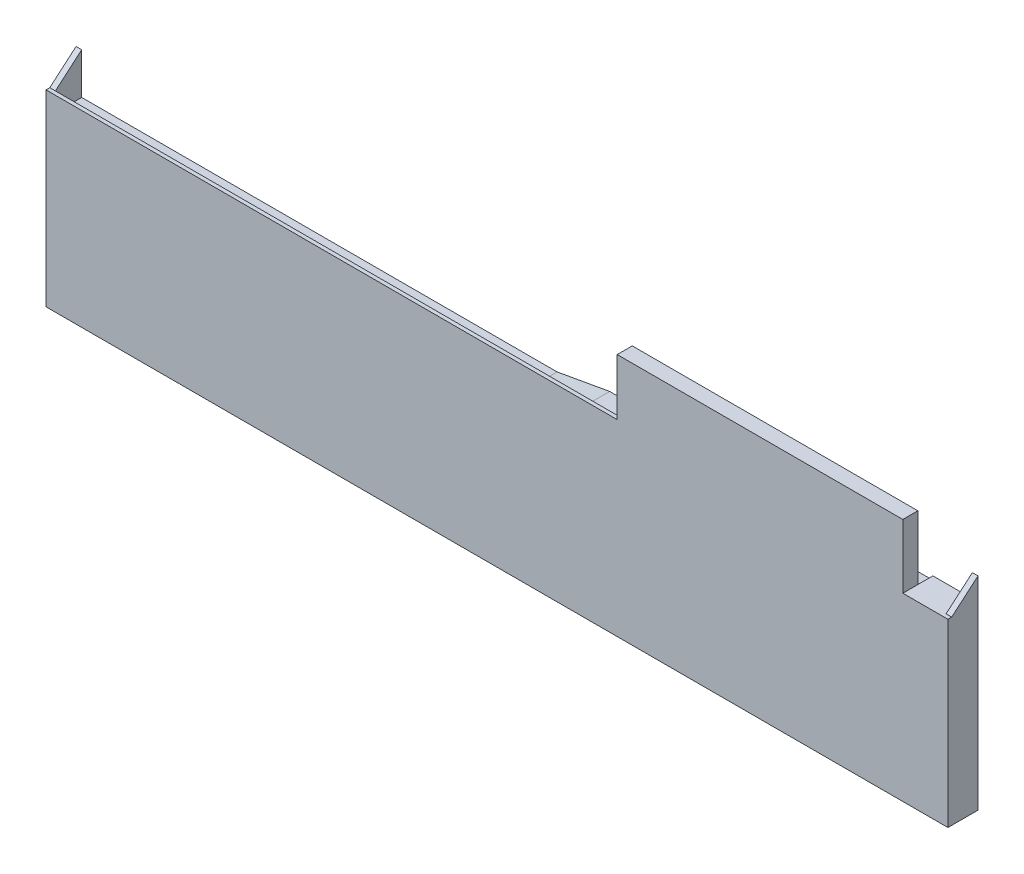
ISO-10303-21;
HEADER;
FILE_DESCRIPTION(('STEP AP214'),'2;1');
FILE_NAME('part.step','',(''),(''),'','','');
FILE_SCHEMA(('AUTOMOTIVE_DESIGN { 1 0 10303 214 1 1 1 1 }'));
ENDSEC;
DATA;
#1=APPLICATION_CONTEXT('core data for automotive mechanical design processes');
#2=APPLICATION_PROTOCOL_DEFINITION('international standard','automotive_design',2000,#1);
#3=PRODUCT_CONTEXT('',#1,'mechanical');
#4=PRODUCT('Part','Part','',(#3));
#5=PRODUCT_RELATED_PRODUCT_CATEGORY('part','',(#4));
#6=PRODUCT_DEFINITION_FORMATION('','',#4);
#7=PRODUCT_DEFINITION_CONTEXT('part definition',#1,'design');
#8=PRODUCT_DEFINITION('design','',#6,#7);
#9=PRODUCT_DEFINITION_SHAPE('','',#8);
#10=(LENGTH_UNIT() NAMED_UNIT(*) SI_UNIT(.MILLI.,.METRE.));
#11=(NAMED_UNIT(*) PLANE_ANGLE_UNIT() SI_UNIT($,.RADIAN.));
#12=(NAMED_UNIT(*) SI_UNIT($,.STERADIAN.) SOLID_ANGLE_UNIT());
#13=UNCERTAINTY_MEASURE_WITH_UNIT(LENGTH_MEASURE(1.E-05),#10,'distance_accuracy_value','');
#14=(GEOMETRIC_REPRESENTATION_CONTEXT(3) GLOBAL_UNCERTAINTY_ASSIGNED_CONTEXT((#13)) GLOBAL_UNIT_ASSIGNED_CONTEXT((#10,
#11,#12)) REPRESENTATION_CONTEXT('',''));
#15=CARTESIAN_POINT('',(0.,0.,0.));
#16=DIRECTION('',(0.,0.,1.));
#17=DIRECTION('',(1.,0.,0.));
#18=AXIS2_PLACEMENT_3D('',#15,#16,#17);
#19=CARTESIAN_POINT('',(152.,47.,0.));
#20=DIRECTION('',(-1.,0.,0.));
#21=DIRECTION('',(0.,0.,1.));
#22=AXIS2_PLACEMENT_3D('',#19,#20,#21);
#23=PLANE('',#22);
#24=DIRECTION('',(0.,0.,-1.));
#25=VECTOR('',#24,1.);
#26=CARTESIAN_POINT('',(152.,47.5,0.));
#27=LINE('',#26,#25);
#28=CARTESIAN_POINT('',(152.,47.5,4.));
#29=VERTEX_POINT('',#28);
#30=CARTESIAN_POINT('',(152.,47.5,0.));
#31=VERTEX_POINT('',#30);
#32=EDGE_CURVE('E11',#29,#31,#27,.T.);
#33=ORIENTED_EDGE('',*,*,#32,.F.);
#34=DIRECTION('',(0.,1.,0.));
#35=VECTOR('',#34,1.);
#36=CARTESIAN_POINT('',(152.,47.,4.));
#37=LINE('',#36,#35);
#38=CARTESIAN_POINT('',(152.,47.,4.));
#39=VERTEX_POINT('',#38);
#40=EDGE_CURVE('E333',#39,#29,#37,.T.);
#41=ORIENTED_EDGE('',*,*,#40,.F.);
#42=DIRECTION('',(0.,0.,1.));
#43=VECTOR('',#42,1.);
#44=CARTESIAN_POINT('',(152.,47.,0.));
#45=LINE('',#44,#43);
#46=CARTESIAN_POINT('',(152.,47.,0.));
#47=VERTEX_POINT('',#46);
#48=EDGE_CURVE('E316',#47,#39,#45,.T.);
#49=ORIENTED_EDGE('',*,*,#48,.F.);
#50=DIRECTION('',(0.,1.,0.));
#51=VECTOR('',#50,1.);
#52=CARTESIAN_POINT('',(152.,47.,0.));
#53=LINE('',#52,#51);
#54=EDGE_CURVE('E338',#47,#31,#53,.T.);
#55=ORIENTED_EDGE('',*,*,#54,.T.);
#56=EDGE_LOOP('',(#33,#41,#49,#55));
#57=FACE_BOUND('',#56,.T.);
#58=ADVANCED_FACE('F41',(#57),#23,.F.);
#59=CARTESIAN_POINT('',(0.,0.,8.));
#60=DIRECTION('',(1.,0.,0.));
#61=DIRECTION('',(0.,0.,-1.));
#62=AXIS2_PLACEMENT_3D('',#59,#60,#61);
#63=PLANE('',#62);
#64=DIRECTION('',(0.,0.,-1.));
#65=VECTOR('',#64,1.);
#66=CARTESIAN_POINT('',(0.,50.,8.));
#67=LINE('',#66,#65);
#68=CARTESIAN_POINT('',(0.,50.,8.));
#69=VERTEX_POINT('',#68);
#70=CARTESIAN_POINT('',(0.,50.,7.));
#71=VERTEX_POINT('',#70);
#72=EDGE_CURVE('E427',#69,#71,#67,.T.);
#73=ORIENTED_EDGE('',*,*,#72,.T.);
#74=DIRECTION('',(0.,0.650791373455968,-0.759256602365297));
#75=VECTOR('',#74,1.);
#76=CARTESIAN_POINT('',(0.,56.,0.));
#77=LINE('',#76,#75);
#78=CARTESIAN_POINT('',(0.,56.,0.));
#79=VERTEX_POINT('',#78);
#80=EDGE_CURVE('E233',#71,#79,#77,.T.);
#81=ORIENTED_EDGE('',*,*,#80,.T.);
#82=DIRECTION('',(0.,-1.,0.));
#83=VECTOR('',#82,1.);
#84=CARTESIAN_POINT('',(0.,0.,0.));
#85=LINE('',#84,#83);
#86=CARTESIAN_POINT('',(0.,0.,0.));
#87=VERTEX_POINT('',#86);
#88=EDGE_CURVE('E211',#79,#87,#85,.T.);
#89=ORIENTED_EDGE('',*,*,#88,.T.);
#90=DIRECTION('',(0.,0.,-1.));
#91=VECTOR('',#90,1.);
#92=CARTESIAN_POINT('',(0.,0.,8.));
#93=LINE('',#92,#91);
#94=CARTESIAN_POINT('',(0.,0.,8.));
#95=VERTEX_POINT('',#94);
#96=EDGE_CURVE('E50',#95,#87,#93,.T.);
#97=ORIENTED_EDGE('',*,*,#96,.F.);
#98=DIRECTION('',(0.,-1.,0.));
#99=VECTOR('',#98,1.);
#100=CARTESIAN_POINT('',(0.,0.,8.));
#101=LINE('',#100,#99);
#102=EDGE_CURVE('E401',#69,#95,#101,.T.);
#103=ORIENTED_EDGE('',*,*,#102,.F.);
#104=EDGE_LOOP('',(#73,#81,#89,#97,#103));
#105=FACE_BOUND('',#104,.T.);
#106=ADVANCED_FACE('F43',(#105),#63,.F.);
#107=CARTESIAN_POINT('',(0.,0.,8.));
#108=DIRECTION('',(0.,1.,0.));
#109=DIRECTION('',(0.,0.,1.));
#110=AXIS2_PLACEMENT_3D('',#107,#108,#109);
#111=PLANE('',#110);
#112=DIRECTION('',(1.,0.,0.));
#113=VECTOR('',#112,1.);
#114=CARTESIAN_POINT('',(0.,0.,0.));
#115=LINE('',#114,#113);
#116=CARTESIAN_POINT('',(240.,0.,0.));
#117=VERTEX_POINT('',#116);
#118=EDGE_CURVE('E430',#87,#117,#115,.T.);
#119=ORIENTED_EDGE('',*,*,#118,.T.);
#120=DIRECTION('',(0.,0.,-1.));
#121=VECTOR('',#120,1.);
#122=CARTESIAN_POINT('',(240.,0.,8.));
#123=LINE('',#122,#121);
#124=CARTESIAN_POINT('',(240.,0.,8.));
#125=VERTEX_POINT('',#124);
#126=EDGE_CURVE('E460',#125,#117,#123,.T.);
#127=ORIENTED_EDGE('',*,*,#126,.F.);
#128=DIRECTION('',(1.,0.,0.));
#129=VECTOR('',#128,1.);
#130=CARTESIAN_POINT('',(0.,0.,8.));
#131=LINE('',#130,#129);
#132=EDGE_CURVE('E405',#95,#125,#131,.T.);
#133=ORIENTED_EDGE('',*,*,#132,.F.);
#134=ORIENTED_EDGE('',*,*,#96,.T.);
#135=EDGE_LOOP('',(#119,#127,#133,#134));
#136=FACE_BOUND('',#135,.T.);
#137=ADVANCED_FACE('F467',(#136),#111,.F.);
#138=CARTESIAN_POINT('',(240.,0.,8.));
#139=DIRECTION('',(-1.,0.,0.));
#140=DIRECTION('',(0.,0.,1.));
#141=AXIS2_PLACEMENT_3D('',#138,#139,#140);
#142=PLANE('',#141);
#143=DIRECTION('',(0.,1.,0.));
#144=VECTOR('',#143,1.);
#145=CARTESIAN_POINT('',(240.,0.,0.));
#146=LINE('',#145,#144);
#147=CARTESIAN_POINT('',(240.,54.,0.));
#148=VERTEX_POINT('',#147);
#149=EDGE_CURVE('E433',#117,#148,#146,.T.);
#150=ORIENTED_EDGE('',*,*,#149,.T.);
#151=DIRECTION('',(0.,-0.650791373455968,0.759256602365297));
#152=VECTOR('',#151,1.);
#153=CARTESIAN_POINT('',(240.,54.,0.));
#154=LINE('',#153,#152);
#155=CARTESIAN_POINT('',(240.,48.,7.));
#156=VERTEX_POINT('',#155);
#157=EDGE_CURVE('E217',#148,#156,#154,.T.);
#158=ORIENTED_EDGE('',*,*,#157,.T.);
#159=DIRECTION('',(0.,0.,-1.));
#160=VECTOR('',#159,1.);
#161=CARTESIAN_POINT('',(240.,48.,8.));
#162=LINE('',#161,#160);
#163=CARTESIAN_POINT('',(240.,48.,8.));
#164=VERTEX_POINT('',#163);
#165=EDGE_CURVE('E457',#164,#156,#162,.T.);
#166=ORIENTED_EDGE('',*,*,#165,.F.);
#167=DIRECTION('',(0.,1.,0.));
#168=VECTOR('',#167,1.);
#169=CARTESIAN_POINT('',(240.,0.,8.));
#170=LINE('',#169,#168);
#171=EDGE_CURVE('E409',#125,#164,#170,.T.);
#172=ORIENTED_EDGE('',*,*,#171,.F.);
#173=ORIENTED_EDGE('',*,*,#126,.T.);
#174=EDGE_LOOP('',(#150,#158,#166,#172,#173));
#175=FACE_BOUND('',#174,.T.);
#176=ADVANCED_FACE('F474',(#175),#142,.F.);
#177=CARTESIAN_POINT('',(228.,48.,8.));
#178=DIRECTION('',(0.,-1.,0.));
#179=DIRECTION('',(0.,0.,-1.));
#180=AXIS2_PLACEMENT_3D('',#177,#178,#179);
#181=PLANE('',#180);
#182=ORIENTED_EDGE('',*,*,#165,.T.);
#183=DIRECTION('',(1.,0.,0.));
#184=VECTOR('',#183,1.);
#185=CARTESIAN_POINT('',(238.5,48.,7.));
#186=LINE('',#185,#184);
#187=CARTESIAN_POINT('',(238.5,48.,7.));
#188=VERTEX_POINT('',#187);
#189=EDGE_CURVE('E267',#188,#156,#186,.T.);
#190=ORIENTED_EDGE('',*,*,#189,.F.);
#191=DIRECTION('',(0.,0.,-1.));
#192=VECTOR('',#191,1.);
#193=CARTESIAN_POINT('',(238.5,48.,0.));
#194=LINE('',#193,#192);
#195=CARTESIAN_POINT('',(238.5,48.,0.));
#196=VERTEX_POINT('',#195);
#197=EDGE_CURVE('E251',#188,#196,#194,.T.);
#198=ORIENTED_EDGE('',*,*,#197,.T.);
#199=DIRECTION('',(-1.,0.,0.));
#200=VECTOR('',#199,1.);
#201=CARTESIAN_POINT('',(228.,48.,0.));
#202=LINE('',#201,#200);
#203=CARTESIAN_POINT('',(228.,48.,0.));
#204=VERTEX_POINT('',#203);
#205=EDGE_CURVE('E406',#196,#204,#202,.T.);
#206=ORIENTED_EDGE('',*,*,#205,.T.);
#207=DIRECTION('',(0.,0.,1.));
#208=VECTOR('',#207,1.);
#209=CARTESIAN_POINT('',(228.,48.,8.));
#210=LINE('',#209,#208);
#211=CARTESIAN_POINT('',(228.,48.,4.));
#212=VERTEX_POINT('',#211);
#213=EDGE_CURVE('E331',#204,#212,#210,.T.);
#214=ORIENTED_EDGE('',*,*,#213,.T.);
#215=DIRECTION('',(0.,0.,-1.));
#216=VECTOR('',#215,1.);
#217=CARTESIAN_POINT('',(228.,48.,8.));
#218=LINE('',#217,#216);
#219=CARTESIAN_POINT('',(228.,48.,8.));
#220=VERTEX_POINT('',#219);
#221=EDGE_CURVE('E453',#220,#212,#218,.T.);
#222=ORIENTED_EDGE('',*,*,#221,.F.);
#223=DIRECTION('',(-1.,0.,0.));
#224=VECTOR('',#223,1.);
#225=CARTESIAN_POINT('',(228.,48.,8.));
#226=LINE('',#225,#224);
#227=EDGE_CURVE('E412',#164,#220,#226,.T.);
#228=ORIENTED_EDGE('',*,*,#227,.F.);
#229=EDGE_LOOP('',(#182,#190,#198,#206,#214,#222,#228));
#230=FACE_BOUND('',#229,.T.);
#231=ADVANCED_FACE('F568',(#230),#181,.F.);
#232=CARTESIAN_POINT('',(228.,65.,8.));
#233=DIRECTION('',(-1.,0.,0.));
#234=DIRECTION('',(0.,0.,1.));
#235=AXIS2_PLACEMENT_3D('',#232,#233,#234);
#236=PLANE('',#235);
#237=ORIENTED_EDGE('',*,*,#221,.T.);
#238=DIRECTION('',(0.,1.,0.));
#239=VECTOR('',#238,1.);
#240=CARTESIAN_POINT('',(228.,47.,4.));
#241=LINE('',#240,#239);
#242=CARTESIAN_POINT('',(228.,65.,4.));
#243=VERTEX_POINT('',#242);
#244=EDGE_CURVE('E332',#212,#243,#241,.T.);
#245=ORIENTED_EDGE('',*,*,#244,.T.);
#246=DIRECTION('',(0.,0.,-1.));
#247=VECTOR('',#246,1.);
#248=CARTESIAN_POINT('',(228.,65.,8.));
#249=LINE('',#248,#247);
#250=CARTESIAN_POINT('',(228.,65.,8.));
#251=VERTEX_POINT('',#250);
#252=EDGE_CURVE('E449',#251,#243,#249,.T.);
#253=ORIENTED_EDGE('',*,*,#252,.F.);
#254=DIRECTION('',(0.,1.,0.));
#255=VECTOR('',#254,1.);
#256=CARTESIAN_POINT('',(228.,65.,8.));
#257=LINE('',#256,#255);
#258=EDGE_CURVE('E415',#220,#251,#257,.T.);
#259=ORIENTED_EDGE('',*,*,#258,.F.);
#260=EDGE_LOOP('',(#237,#245,#253,#259));
#261=FACE_BOUND('',#260,.T.);
#262=ADVANCED_FACE('F571',(#261),#236,.F.);
#263=CARTESIAN_POINT('',(152.,65.,8.));
#264=DIRECTION('',(0.,-1.,0.));
#265=DIRECTION('',(0.,0.,-1.));
#266=AXIS2_PLACEMENT_3D('',#263,#264,#265);
#267=PLANE('',#266);
#268=ORIENTED_EDGE('',*,*,#252,.T.);
#269=DIRECTION('',(1.,0.,0.));
#270=VECTOR('',#269,1.);
#271=CARTESIAN_POINT('',(228.,65.,4.));
#272=LINE('',#271,#270);
#273=CARTESIAN_POINT('',(152.,65.,4.));
#274=VERTEX_POINT('',#273);
#275=EDGE_CURVE('E307',#274,#243,#272,.T.);
#276=ORIENTED_EDGE('',*,*,#275,.F.);
#277=DIRECTION('',(0.,0.,-1.));
#278=VECTOR('',#277,1.);
#279=CARTESIAN_POINT('',(152.,65.,8.));
#280=LINE('',#279,#278);
#281=CARTESIAN_POINT('',(152.,65.,8.));
#282=VERTEX_POINT('',#281);
#283=EDGE_CURVE('E445',#282,#274,#280,.T.);
#284=ORIENTED_EDGE('',*,*,#283,.F.);
#285=DIRECTION('',(-1.,0.,0.));
#286=VECTOR('',#285,1.);
#287=CARTESIAN_POINT('',(152.,65.,8.));
#288=LINE('',#287,#286);
#289=EDGE_CURVE('E418',#251,#282,#288,.T.);
#290=ORIENTED_EDGE('',*,*,#289,.F.);
#291=EDGE_LOOP('',(#268,#276,#284,#290));
#292=FACE_BOUND('',#291,.T.);
#293=ADVANCED_FACE('F500',(#292),#267,.F.);
#294=CARTESIAN_POINT('',(152.,50.,8.));
#295=DIRECTION('',(1.,0.,0.));
#296=DIRECTION('',(0.,0.,-1.));
#297=AXIS2_PLACEMENT_3D('',#294,#295,#296);
#298=PLANE('',#297);
#299=ORIENTED_EDGE('',*,*,#283,.T.);
#300=EDGE_CURVE('E337',#29,#274,#37,.T.);
#301=ORIENTED_EDGE('',*,*,#300,.F.);
#302=DIRECTION('',(0.,0.,-1.));
#303=VECTOR('',#302,1.);
#304=CARTESIAN_POINT('',(152.,47.5,5.5));
#305=LINE('',#304,#303);
#306=CARTESIAN_POINT('',(152.,47.5,5.5));
#307=VERTEX_POINT('',#306);
#308=EDGE_CURVE('E292',#307,#29,#305,.T.);
#309=ORIENTED_EDGE('',*,*,#308,.F.);
#310=DIRECTION('',(0.,1.,0.));
#311=VECTOR('',#310,1.);
#312=CARTESIAN_POINT('',(152.,47.5,5.5));
#313=LINE('',#312,#311);
#314=CARTESIAN_POINT('',(152.,48.5,5.5));
#315=VERTEX_POINT('',#314);
#316=EDGE_CURVE('E303',#307,#315,#313,.T.);
#317=ORIENTED_EDGE('',*,*,#316,.T.);
#318=DIRECTION('',(0.,0.,-1.));
#319=VECTOR('',#318,1.);
#320=CARTESIAN_POINT('',(152.,48.5,7.));
#321=LINE('',#320,#319);
#322=CARTESIAN_POINT('',(152.,48.5,7.));
#323=VERTEX_POINT('',#322);
#324=EDGE_CURVE('E388',#323,#315,#321,.T.);
#325=ORIENTED_EDGE('',*,*,#324,.F.);
#326=DIRECTION('',(0.,1.,0.));
#327=VECTOR('',#326,1.);
#328=CARTESIAN_POINT('',(152.,48.5,7.));
#329=LINE('',#328,#327);
#330=CARTESIAN_POINT('',(152.,50.,7.));
#331=VERTEX_POINT('',#330);
#332=EDGE_CURVE('E395',#323,#331,#329,.T.);
#333=ORIENTED_EDGE('',*,*,#332,.T.);
#334=DIRECTION('',(0.,0.,-1.));
#335=VECTOR('',#334,1.);
#336=CARTESIAN_POINT('',(152.,50.,8.));
#337=LINE('',#336,#335);
#338=CARTESIAN_POINT('',(152.,50.,8.));
#339=VERTEX_POINT('',#338);
#340=EDGE_CURVE('E441',#339,#331,#337,.T.);
#341=ORIENTED_EDGE('',*,*,#340,.F.);
#342=DIRECTION('',(0.,-1.,0.));
#343=VECTOR('',#342,1.);
#344=CARTESIAN_POINT('',(152.,50.,8.));
#345=LINE('',#344,#343);
#346=EDGE_CURVE('E421',#282,#339,#345,.T.);
#347=ORIENTED_EDGE('',*,*,#346,.F.);
#348=EDGE_LOOP('',(#299,#301,#309,#317,#325,#333,#341,#347));
#349=FACE_BOUND('',#348,.T.);
#350=ADVANCED_FACE('F503',(#349),#298,.F.);
#351=CARTESIAN_POINT('',(0.,50.,8.));
#352=DIRECTION('',(0.,-1.,0.));
#353=DIRECTION('',(0.,0.,-1.));
#354=AXIS2_PLACEMENT_3D('',#351,#352,#353);
#355=PLANE('',#354);
#356=ORIENTED_EDGE('',*,*,#340,.T.);
#357=DIRECTION('',(1.,0.,0.));
#358=VECTOR('',#357,1.);
#359=CARTESIAN_POINT('',(152.,50.,7.));
#360=LINE('',#359,#358);
#361=CARTESIAN_POINT('',(1.5,50.,7.));
#362=VERTEX_POINT('',#361);
#363=EDGE_CURVE('E374',#362,#331,#360,.T.);
#364=ORIENTED_EDGE('',*,*,#363,.F.);
#365=EDGE_CURVE('E229',#71,#362,#360,.T.);
#366=ORIENTED_EDGE('',*,*,#365,.F.);
#367=ORIENTED_EDGE('',*,*,#72,.F.);
#368=DIRECTION('',(-1.,0.,0.));
#369=VECTOR('',#368,1.);
#370=CARTESIAN_POINT('',(0.,50.,8.));
#371=LINE('',#370,#369);
#372=EDGE_CURVE('E424',#339,#69,#371,.T.);
#373=ORIENTED_EDGE('',*,*,#372,.F.);
#374=EDGE_LOOP('',(#356,#364,#366,#367,#373));
#375=FACE_BOUND('',#374,.T.);
#376=ADVANCED_FACE('F486',(#375),#355,.F.);
#377=CARTESIAN_POINT('',(0.,0.,8.));
#378=DIRECTION('',(0.,0.,-1.));
#379=DIRECTION('',(-1.,0.,0.));
#380=AXIS2_PLACEMENT_3D('',#377,#378,#379);
#381=PLANE('',#380);
#382=ORIENTED_EDGE('',*,*,#102,.T.);
#383=ORIENTED_EDGE('',*,*,#132,.T.);
#384=ORIENTED_EDGE('',*,*,#171,.T.);
#385=ORIENTED_EDGE('',*,*,#227,.T.);
#386=ORIENTED_EDGE('',*,*,#258,.T.);
#387=ORIENTED_EDGE('',*,*,#289,.T.);
#388=ORIENTED_EDGE('',*,*,#346,.T.);
#389=ORIENTED_EDGE('',*,*,#372,.T.);
#390=EDGE_LOOP('',(#382,#383,#384,#385,#386,#387,#388,#389));
#391=FACE_BOUND('',#390,.T.);
#392=ADVANCED_FACE('F479',(#391),#381,.F.);
#393=CARTESIAN_POINT('',(0.,0.,0.));
#394=DIRECTION('',(0.,0.,-1.));
#395=DIRECTION('',(-1.,0.,0.));
#396=AXIS2_PLACEMENT_3D('',#393,#394,#395);
#397=PLANE('',#396);
#398=DIRECTION('',(-0.984427575508482,-0.175790638483658,0.));
#399=VECTOR('',#398,1.);
#400=CARTESIAN_POINT('',(142.,47.5,0.));
#401=LINE('',#400,#399);
#402=CARTESIAN_POINT('',(142.,47.5,0.));
#403=VERTEX_POINT('',#402);
#404=CARTESIAN_POINT('',(128.,45.,0.));
#405=VERTEX_POINT('',#404);
#406=EDGE_CURVE('E285',#403,#405,#401,.T.);
#407=ORIENTED_EDGE('',*,*,#406,.F.);
#408=DIRECTION('',(-1.,0.,0.));
#409=VECTOR('',#408,1.);
#410=CARTESIAN_POINT('',(152.,47.5,0.));
#411=LINE('',#410,#409);
#412=EDGE_CURVE('E296',#31,#403,#411,.T.);
#413=ORIENTED_EDGE('',*,*,#412,.F.);
#414=ORIENTED_EDGE('',*,*,#54,.F.);
#415=DIRECTION('',(-1.,0.,0.));
#416=VECTOR('',#415,1.);
#417=CARTESIAN_POINT('',(228.,47.,0.));
#418=LINE('',#417,#416);
#419=CARTESIAN_POINT('',(228.,47.,0.));
#420=VERTEX_POINT('',#419);
#421=EDGE_CURVE('E312',#420,#47,#418,.T.);
#422=ORIENTED_EDGE('',*,*,#421,.F.);
#423=DIRECTION('',(0.,1.,0.));
#424=VECTOR('',#423,1.);
#425=CARTESIAN_POINT('',(228.,47.,0.));
#426=LINE('',#425,#424);
#427=EDGE_CURVE('E324',#420,#204,#426,.T.);
#428=ORIENTED_EDGE('',*,*,#427,.T.);
#429=ORIENTED_EDGE('',*,*,#205,.F.);
#430=DIRECTION('',(0.,1.,0.));
#431=VECTOR('',#430,1.);
#432=CARTESIAN_POINT('',(238.5,48.,0.));
#433=LINE('',#432,#431);
#434=CARTESIAN_POINT('',(238.5,54.,0.));
#435=VERTEX_POINT('',#434);
#436=EDGE_CURVE('E255',#196,#435,#433,.T.);
#437=ORIENTED_EDGE('',*,*,#436,.T.);
#438=DIRECTION('',(1.,0.,0.));
#439=VECTOR('',#438,1.);
#440=CARTESIAN_POINT('',(238.5,54.,0.));
#441=LINE('',#440,#439);
#442=EDGE_CURVE('E263',#435,#148,#441,.T.);
#443=ORIENTED_EDGE('',*,*,#442,.T.);
#444=ORIENTED_EDGE('',*,*,#149,.F.);
#445=ORIENTED_EDGE('',*,*,#118,.F.);
#446=ORIENTED_EDGE('',*,*,#88,.F.);
#447=DIRECTION('',(-1.,0.,0.));
#448=VECTOR('',#447,1.);
#449=CARTESIAN_POINT('',(1.5,56.,0.));
#450=LINE('',#449,#448);
#451=CARTESIAN_POINT('',(1.5,56.,0.));
#452=VERTEX_POINT('',#451);
#453=EDGE_CURVE('E203',#452,#79,#450,.T.);
#454=ORIENTED_EDGE('',*,*,#453,.F.);
#455=DIRECTION('',(0.,-1.,0.));
#456=VECTOR('',#455,1.);
#457=CARTESIAN_POINT('',(1.5,50.,0.));
#458=LINE('',#457,#456);
#459=CARTESIAN_POINT('',(1.5,45.,0.));
#460=VERTEX_POINT('',#459);
#461=EDGE_CURVE('E208',#452,#460,#458,.T.);
#462=ORIENTED_EDGE('',*,*,#461,.T.);
#463=DIRECTION('',(-1.,0.,0.));
#464=VECTOR('',#463,1.);
#465=CARTESIAN_POINT('',(128.,45.,0.));
#466=LINE('',#465,#464);
#467=EDGE_CURVE('E369',#405,#460,#466,.T.);
#468=ORIENTED_EDGE('',*,*,#467,.F.);
#469=EDGE_LOOP('',(#407,#413,#414,#422,#428,#429,#437,#443,#444,#445,#446,#454,#462,#468));
#470=FACE_BOUND('',#469,.T.);
#471=ADVANCED_FACE('F206',(#470),#397,.T.);
#472=CARTESIAN_POINT('',(152.,48.5,7.));
#473=DIRECTION('',(0.,0.,1.));
#474=DIRECTION('',(1.,0.,0.));
#475=AXIS2_PLACEMENT_3D('',#472,#473,#474);
#476=PLANE('',#475);
#477=DIRECTION('',(1.,0.,0.));
#478=VECTOR('',#477,1.);
#479=CARTESIAN_POINT('',(152.,48.5,7.));
#480=LINE('',#479,#478);
#481=CARTESIAN_POINT('',(1.5,48.5,7.));
#482=VERTEX_POINT('',#481);
#483=EDGE_CURVE('E385',#482,#323,#480,.T.);
#484=ORIENTED_EDGE('',*,*,#483,.F.);
#485=DIRECTION('',(0.,1.,0.));
#486=VECTOR('',#485,1.);
#487=CARTESIAN_POINT('',(1.5,48.5,7.));
#488=LINE('',#487,#486);
#489=EDGE_CURVE('E57',#482,#362,#488,.T.);
#490=ORIENTED_EDGE('',*,*,#489,.T.);
#491=ORIENTED_EDGE('',*,*,#363,.T.);
#492=ORIENTED_EDGE('',*,*,#332,.F.);
#493=EDGE_LOOP('',(#484,#490,#491,#492));
#494=FACE_BOUND('',#493,.T.);
#495=ADVANCED_FACE('F505',(#494),#476,.F.);
#496=CARTESIAN_POINT('',(0.,48.5,0.));
#497=DIRECTION('',(0.,1.,0.));
#498=DIRECTION('',(0.,0.,1.));
#499=AXIS2_PLACEMENT_3D('',#496,#497,#498);
#500=PLANE('',#499);
#501=DIRECTION('',(0.,0.,1.));
#502=VECTOR('',#501,1.);
#503=CARTESIAN_POINT('',(1.5,48.5,5.5));
#504=LINE('',#503,#502);
#505=CARTESIAN_POINT('',(1.5,48.5,5.5));
#506=VERTEX_POINT('',#505);
#507=EDGE_CURVE('E65',#506,#482,#504,.T.);
#508=ORIENTED_EDGE('',*,*,#507,.T.);
#509=ORIENTED_EDGE('',*,*,#483,.T.);
#510=ORIENTED_EDGE('',*,*,#324,.T.);
#511=DIRECTION('',(-1.,0.,0.));
#512=VECTOR('',#511,1.);
#513=CARTESIAN_POINT('',(152.,48.5,5.5));
#514=LINE('',#513,#512);
#515=EDGE_CURVE('E392',#315,#506,#514,.T.);
#516=ORIENTED_EDGE('',*,*,#515,.T.);
#517=EDGE_LOOP('',(#508,#509,#510,#516));
#518=FACE_BOUND('',#517,.T.);
#519=ADVANCED_FACE('F510',(#518),#500,.T.);
#520=CARTESIAN_POINT('',(128.,48.5,5.5));
#521=DIRECTION('',(0.,0.,1.));
#522=DIRECTION('',(1.,0.,0.));
#523=AXIS2_PLACEMENT_3D('',#520,#521,#522);
#524=PLANE('',#523);
#525=DIRECTION('',(-1.,0.,0.));
#526=VECTOR('',#525,1.);
#527=CARTESIAN_POINT('',(128.,46.5,5.5));
#528=LINE('',#527,#526);
#529=CARTESIAN_POINT('',(136.4,46.5,5.5));
#530=VERTEX_POINT('',#529);
#531=CARTESIAN_POINT('',(1.5,46.5,5.5));
#532=VERTEX_POINT('',#531);
#533=EDGE_CURVE('E370',#530,#532,#528,.T.);
#534=ORIENTED_EDGE('',*,*,#533,.T.);
#535=DIRECTION('',(0.,1.,0.));
#536=VECTOR('',#535,1.);
#537=CARTESIAN_POINT('',(1.5,46.5,5.5));
#538=LINE('',#537,#536);
#539=EDGE_CURVE('E244',#532,#506,#538,.T.);
#540=ORIENTED_EDGE('',*,*,#539,.T.);
#541=ORIENTED_EDGE('',*,*,#515,.F.);
#542=ORIENTED_EDGE('',*,*,#316,.F.);
#543=DIRECTION('',(1.,0.,0.));
#544=VECTOR('',#543,1.);
#545=CARTESIAN_POINT('',(142.,47.5,5.5));
#546=LINE('',#545,#544);
#547=CARTESIAN_POINT('',(142.,47.5,5.5));
#548=VERTEX_POINT('',#547);
#549=EDGE_CURVE('E288',#548,#307,#546,.T.);
#550=ORIENTED_EDGE('',*,*,#549,.F.);
#551=DIRECTION('',(-0.984427575508482,-0.175790638483658,0.));
#552=VECTOR('',#551,1.);
#553=CARTESIAN_POINT('',(142.,47.5,5.5));
#554=LINE('',#553,#552);
#555=EDGE_CURVE('E281',#548,#530,#554,.T.);
#556=ORIENTED_EDGE('',*,*,#555,.T.);
#557=EDGE_LOOP('',(#534,#540,#541,#542,#550,#556));
#558=FACE_BOUND('',#557,.T.);
#559=ADVANCED_FACE('F509',(#558),#524,.F.);
#560=CARTESIAN_POINT('',(128.,46.5,5.5));
#561=DIRECTION('',(0.,1.,0.));
#562=DIRECTION('',(0.,0.,1.));
#563=AXIS2_PLACEMENT_3D('',#560,#561,#562);
#564=PLANE('',#563);
#565=DIRECTION('',(-1.,0.,0.));
#566=VECTOR('',#565,1.);
#567=CARTESIAN_POINT('',(128.,46.5,6.5));
#568=LINE('',#567,#566);
#569=CARTESIAN_POINT('',(128.,46.5,6.5));
#570=VERTEX_POINT('',#569);
#571=CARTESIAN_POINT('',(1.5,46.5,6.5));
#572=VERTEX_POINT('',#571);
#573=EDGE_CURVE('E375',#570,#572,#568,.T.);
#574=ORIENTED_EDGE('',*,*,#573,.T.);
#575=DIRECTION('',(0.,0.,-1.));
#576=VECTOR('',#575,1.);
#577=CARTESIAN_POINT('',(1.5,46.5,6.5));
#578=LINE('',#577,#576);
#579=EDGE_CURVE('E241',#572,#532,#578,.T.);
#580=ORIENTED_EDGE('',*,*,#579,.T.);
#581=ORIENTED_EDGE('',*,*,#533,.F.);
#582=DIRECTION('',(0.,0.,-1.));
#583=VECTOR('',#582,1.);
#584=CARTESIAN_POINT('',(136.4,46.5,7.));
#585=LINE('',#584,#583);
#586=CARTESIAN_POINT('',(136.4,46.5,7.));
#587=VERTEX_POINT('',#586);
#588=EDGE_CURVE('E277',#587,#530,#585,.T.);
#589=ORIENTED_EDGE('',*,*,#588,.F.);
#590=DIRECTION('',(1.,0.,0.));
#591=VECTOR('',#590,1.);
#592=CARTESIAN_POINT('',(128.,46.5,7.));
#593=LINE('',#592,#591);
#594=CARTESIAN_POINT('',(128.,46.5,7.));
#595=VERTEX_POINT('',#594);
#596=EDGE_CURVE('E352',#595,#587,#593,.T.);
#597=ORIENTED_EDGE('',*,*,#596,.F.);
#598=DIRECTION('',(0.,0.,-1.));
#599=VECTOR('',#598,1.);
#600=CARTESIAN_POINT('',(128.,46.5,7.));
#601=LINE('',#600,#599);
#602=EDGE_CURVE('E356',#595,#570,#601,.T.);
#603=ORIENTED_EDGE('',*,*,#602,.T.);
#604=EDGE_LOOP('',(#574,#580,#581,#589,#597,#603));
#605=FACE_BOUND('',#604,.T.);
#606=ADVANCED_FACE('F517',(#605),#564,.F.);
#607=CARTESIAN_POINT('',(128.,46.5,6.5));
#608=DIRECTION('',(0.,0.,1.));
#609=DIRECTION('',(1.,0.,0.));
#610=AXIS2_PLACEMENT_3D('',#607,#608,#609);
#611=PLANE('',#610);
#612=DIRECTION('',(-1.,0.,0.));
#613=VECTOR('',#612,1.);
#614=CARTESIAN_POINT('',(128.,45.,6.5));
#615=LINE('',#614,#613);
#616=CARTESIAN_POINT('',(128.,45.,6.5));
#617=VERTEX_POINT('',#616);
#618=CARTESIAN_POINT('',(1.5,45.,6.5));
#619=VERTEX_POINT('',#618);
#620=EDGE_CURVE('E379',#617,#619,#615,.T.);
#621=ORIENTED_EDGE('',*,*,#620,.T.);
#622=DIRECTION('',(0.,1.,0.));
#623=VECTOR('',#622,1.);
#624=CARTESIAN_POINT('',(1.5,45.,6.5));
#625=LINE('',#624,#623);
#626=EDGE_CURVE('E238',#619,#572,#625,.T.);
#627=ORIENTED_EDGE('',*,*,#626,.T.);
#628=ORIENTED_EDGE('',*,*,#573,.F.);
#629=DIRECTION('',(0.,1.,0.));
#630=VECTOR('',#629,1.);
#631=CARTESIAN_POINT('',(128.,46.5,6.5));
#632=LINE('',#631,#630);
#633=EDGE_CURVE('E366',#617,#570,#632,.T.);
#634=ORIENTED_EDGE('',*,*,#633,.F.);
#635=EDGE_LOOP('',(#621,#627,#628,#634));
#636=FACE_BOUND('',#635,.T.);
#637=ADVANCED_FACE('F546',(#636),#611,.F.);
#638=CARTESIAN_POINT('',(128.,45.,6.5));
#639=DIRECTION('',(0.,-1.,0.));
#640=DIRECTION('',(0.,0.,-1.));
#641=AXIS2_PLACEMENT_3D('',#638,#639,#640);
#642=PLANE('',#641);
#643=ORIENTED_EDGE('',*,*,#467,.T.);
#644=DIRECTION('',(0.,0.,1.));
#645=VECTOR('',#644,1.);
#646=CARTESIAN_POINT('',(1.5,45.,0.));
#647=LINE('',#646,#645);
#648=EDGE_CURVE('E224',#460,#619,#647,.T.);
#649=ORIENTED_EDGE('',*,*,#648,.T.);
#650=ORIENTED_EDGE('',*,*,#620,.F.);
#651=DIRECTION('',(0.,0.,1.));
#652=VECTOR('',#651,1.);
#653=CARTESIAN_POINT('',(128.,45.,6.5));
#654=LINE('',#653,#652);
#655=EDGE_CURVE('E360',#405,#617,#654,.T.);
#656=ORIENTED_EDGE('',*,*,#655,.F.);
#657=EDGE_LOOP('',(#643,#649,#650,#656));
#658=FACE_BOUND('',#657,.T.);
#659=ADVANCED_FACE('F541',(#658),#642,.F.);
#660=CARTESIAN_POINT('',(128.,45.,7.));
#661=DIRECTION('',(-1.,0.,0.));
#662=DIRECTION('',(0.,0.,1.));
#663=AXIS2_PLACEMENT_3D('',#660,#661,#662);
#664=PLANE('',#663);
#665=ORIENTED_EDGE('',*,*,#602,.F.);
#666=DIRECTION('',(0.,1.,0.));
#667=VECTOR('',#666,1.);
#668=CARTESIAN_POINT('',(128.,45.,7.));
#669=LINE('',#668,#667);
#670=CARTESIAN_POINT('',(128.,45.,7.));
#671=VERTEX_POINT('',#670);
#672=EDGE_CURVE('E348',#671,#595,#669,.T.);
#673=ORIENTED_EDGE('',*,*,#672,.F.);
#674=DIRECTION('',(0.,0.,-1.));
#675=VECTOR('',#674,1.);
#676=CARTESIAN_POINT('',(128.,45.,7.));
#677=LINE('',#676,#675);
#678=EDGE_CURVE('E355',#671,#617,#677,.T.);
#679=ORIENTED_EDGE('',*,*,#678,.T.);
#680=ORIENTED_EDGE('',*,*,#633,.T.);
#681=EDGE_LOOP('',(#665,#673,#679,#680));
#682=FACE_BOUND('',#681,.T.);
#683=ADVANCED_FACE('F538',(#682),#664,.F.);
#684=CARTESIAN_POINT('',(0.,0.,7.));
#685=DIRECTION('',(0.,0.,-1.));
#686=DIRECTION('',(-1.,0.,0.));
#687=AXIS2_PLACEMENT_3D('',#684,#685,#686);
#688=PLANE('',#687);
#689=ORIENTED_EDGE('',*,*,#596,.T.);
#690=DIRECTION('',(-0.984427575508482,-0.175790638483659,0.));
#691=VECTOR('',#690,1.);
#692=CARTESIAN_POINT('',(136.4,46.5,7.));
#693=LINE('',#692,#691);
#694=EDGE_CURVE('E271',#587,#671,#693,.T.);
#695=ORIENTED_EDGE('',*,*,#694,.T.);
#696=ORIENTED_EDGE('',*,*,#672,.T.);
#697=EDGE_LOOP('',(#689,#695,#696));
#698=FACE_BOUND('',#697,.T.);
#699=ADVANCED_FACE('F534',(#698),#688,.T.);
#700=CARTESIAN_POINT('',(228.,47.,4.));
#701=DIRECTION('',(1.,0.,0.));
#702=DIRECTION('',(0.,0.,-1.));
#703=AXIS2_PLACEMENT_3D('',#700,#701,#702);
#704=PLANE('',#703);
#705=ORIENTED_EDGE('',*,*,#427,.F.);
#706=DIRECTION('',(0.,0.,-1.));
#707=VECTOR('',#706,1.);
#708=CARTESIAN_POINT('',(228.,47.,4.));
#709=LINE('',#708,#707);
#710=CARTESIAN_POINT('',(228.,47.,4.));
#711=VERTEX_POINT('',#710);
#712=EDGE_CURVE('E308',#711,#420,#709,.T.);
#713=ORIENTED_EDGE('',*,*,#712,.F.);
#714=EDGE_CURVE('E327',#711,#212,#241,.T.);
#715=ORIENTED_EDGE('',*,*,#714,.T.);
#716=ORIENTED_EDGE('',*,*,#213,.F.);
#717=EDGE_LOOP('',(#705,#713,#715,#716));
#718=FACE_BOUND('',#717,.T.);
#719=ADVANCED_FACE('F531',(#718),#704,.F.);
#720=CARTESIAN_POINT('',(228.,47.,4.));
#721=DIRECTION('',(0.,0.,1.));
#722=DIRECTION('',(1.,0.,0.));
#723=AXIS2_PLACEMENT_3D('',#720,#721,#722);
#724=PLANE('',#723);
#725=ORIENTED_EDGE('',*,*,#275,.T.);
#726=ORIENTED_EDGE('',*,*,#244,.F.);
#727=ORIENTED_EDGE('',*,*,#714,.F.);
#728=DIRECTION('',(1.,0.,0.));
#729=VECTOR('',#728,1.);
#730=CARTESIAN_POINT('',(228.,47.,4.));
#731=LINE('',#730,#729);
#732=EDGE_CURVE('E320',#39,#711,#731,.T.);
#733=ORIENTED_EDGE('',*,*,#732,.F.);
#734=ORIENTED_EDGE('',*,*,#40,.T.);
#735=ORIENTED_EDGE('',*,*,#300,.T.);
#736=EDGE_LOOP('',(#725,#726,#727,#733,#734,#735));
#737=FACE_BOUND('',#736,.T.);
#738=ADVANCED_FACE('F494',(#737),#724,.F.);
#739=CARTESIAN_POINT('',(0.,47.,0.));
#740=DIRECTION('',(0.,1.,0.));
#741=DIRECTION('',(0.,0.,1.));
#742=AXIS2_PLACEMENT_3D('',#739,#740,#741);
#743=PLANE('',#742);
#744=ORIENTED_EDGE('',*,*,#712,.T.);
#745=ORIENTED_EDGE('',*,*,#421,.T.);
#746=ORIENTED_EDGE('',*,*,#48,.T.);
#747=ORIENTED_EDGE('',*,*,#732,.T.);
#748=EDGE_LOOP('',(#744,#745,#746,#747));
#749=FACE_BOUND('',#748,.T.);
#750=ADVANCED_FACE('F564',(#749),#743,.T.);
#751=CARTESIAN_POINT('',(0.,47.5,0.));
#752=DIRECTION('',(0.,1.,0.));
#753=DIRECTION('',(0.,0.,1.));
#754=AXIS2_PLACEMENT_3D('',#751,#752,#753);
#755=PLANE('',#754);
#756=ORIENTED_EDGE('',*,*,#549,.T.);
#757=ORIENTED_EDGE('',*,*,#308,.T.);
#758=ORIENTED_EDGE('',*,*,#32,.T.);
#759=ORIENTED_EDGE('',*,*,#412,.T.);
#760=DIRECTION('',(0.,0.,1.));
#761=VECTOR('',#760,1.);
#762=CARTESIAN_POINT('',(142.,47.5,0.));
#763=LINE('',#762,#761);
#764=EDGE_CURVE('E300',#403,#548,#763,.T.);
#765=ORIENTED_EDGE('',*,*,#764,.T.);
#766=EDGE_LOOP('',(#756,#757,#758,#759,#765));
#767=FACE_BOUND('',#766,.T.);
#768=ADVANCED_FACE('F560',(#767),#755,.T.);
#769=CARTESIAN_POINT('',(142.,47.5,5.));
#770=DIRECTION('',(0.175790638483658,-0.984427575508482,0.));
#771=DIRECTION('',(0.984427575508482,0.175790638483658,0.));
#772=AXIS2_PLACEMENT_3D('',#769,#770,#771);
#773=PLANE('',#772);
#774=ORIENTED_EDGE('',*,*,#406,.T.);
#775=ORIENTED_EDGE('',*,*,#655,.T.);
#776=ORIENTED_EDGE('',*,*,#678,.F.);
#777=ORIENTED_EDGE('',*,*,#694,.F.);
#778=ORIENTED_EDGE('',*,*,#588,.T.);
#779=ORIENTED_EDGE('',*,*,#555,.F.);
#780=ORIENTED_EDGE('',*,*,#764,.F.);
#781=EDGE_LOOP('',(#774,#775,#776,#777,#778,#779,#780));
#782=FACE_BOUND('',#781,.T.);
#783=ADVANCED_FACE('F611',(#782),#773,.F.);
#784=CARTESIAN_POINT('',(238.5,54.,0.));
#785=DIRECTION('',(0.,0.759256602365297,0.650791373455968));
#786=DIRECTION('',(0.,-0.650791373455968,0.759256602365297));
#787=AXIS2_PLACEMENT_3D('',#784,#785,#786);
#788=PLANE('',#787);
#789=ORIENTED_EDGE('',*,*,#157,.F.);
#790=ORIENTED_EDGE('',*,*,#442,.F.);
#791=DIRECTION('',(0.,-0.650791373455968,0.759256602365297));
#792=VECTOR('',#791,1.);
#793=CARTESIAN_POINT('',(238.5,54.,0.));
#794=LINE('',#793,#792);
#795=EDGE_CURVE('E259',#435,#188,#794,.T.);
#796=ORIENTED_EDGE('',*,*,#795,.T.);
#797=ORIENTED_EDGE('',*,*,#189,.T.);
#798=EDGE_LOOP('',(#789,#790,#796,#797));
#799=FACE_BOUND('',#798,.T.);
#800=ADVANCED_FACE('F605',(#799),#788,.T.);
#801=CARTESIAN_POINT('',(238.5,0.,0.));
#802=DIRECTION('',(-1.,0.,0.));
#803=DIRECTION('',(0.,0.,1.));
#804=AXIS2_PLACEMENT_3D('',#801,#802,#803);
#805=PLANE('',#804);
#806=ORIENTED_EDGE('',*,*,#197,.F.);
#807=ORIENTED_EDGE('',*,*,#795,.F.);
#808=ORIENTED_EDGE('',*,*,#436,.F.);
#809=EDGE_LOOP('',(#806,#807,#808));
#810=FACE_BOUND('',#809,.T.);
#811=ADVANCED_FACE('F610',(#810),#805,.T.);
#812=CARTESIAN_POINT('',(1.5,56.,0.));
#813=DIRECTION('',(0.,0.759256602365297,0.650791373455968));
#814=DIRECTION('',(0.,-0.650791373455968,0.759256602365297));
#815=AXIS2_PLACEMENT_3D('',#812,#813,#814);
#816=PLANE('',#815);
#817=ORIENTED_EDGE('',*,*,#80,.F.);
#818=ORIENTED_EDGE('',*,*,#365,.T.);
#819=DIRECTION('',(0.,0.650791373455968,-0.759256602365297));
#820=VECTOR('',#819,1.);
#821=CARTESIAN_POINT('',(1.5,56.,0.));
#822=LINE('',#821,#820);
#823=EDGE_CURVE('E222',#362,#452,#822,.T.);
#824=ORIENTED_EDGE('',*,*,#823,.T.);
#825=ORIENTED_EDGE('',*,*,#453,.T.);
#826=EDGE_LOOP('',(#817,#818,#824,#825));
#827=FACE_BOUND('',#826,.T.);
#828=ADVANCED_FACE('F228',(#827),#816,.T.);
#829=CARTESIAN_POINT('',(1.5,0.,0.));
#830=DIRECTION('',(1.,0.,0.));
#831=DIRECTION('',(0.,0.,-1.));
#832=AXIS2_PLACEMENT_3D('',#829,#830,#831);
#833=PLANE('',#832);
#834=ORIENTED_EDGE('',*,*,#489,.F.);
#835=ORIENTED_EDGE('',*,*,#507,.F.);
#836=ORIENTED_EDGE('',*,*,#539,.F.);
#837=ORIENTED_EDGE('',*,*,#579,.F.);
#838=ORIENTED_EDGE('',*,*,#626,.F.);
#839=ORIENTED_EDGE('',*,*,#648,.F.);
#840=ORIENTED_EDGE('',*,*,#461,.F.);
#841=ORIENTED_EDGE('',*,*,#823,.F.);
#842=EDGE_LOOP('',(#834,#835,#836,#837,#838,#839,#840,#841));
#843=FACE_BOUND('',#842,.T.);
#844=ADVANCED_FACE('F221',(#843),#833,.T.);
#845=CLOSED_SHELL('',(#58,#106,#137,#176,#231,#262,#293,#350,#376,#392,#471,#495,#519,#559,#606,
#637,#659,#683,#699,#719,#738,#750,#768,#783,#800,#811,#828,#844));
#846=MANIFOLD_SOLID_BREP('B2',#845);
#847=ADVANCED_BREP_SHAPE_REPRESENTATION('',(#18,#846),#14);
#848=SHAPE_DEFINITION_REPRESENTATION(#9,#847);
ENDSEC;
END-ISO-10303-21;
